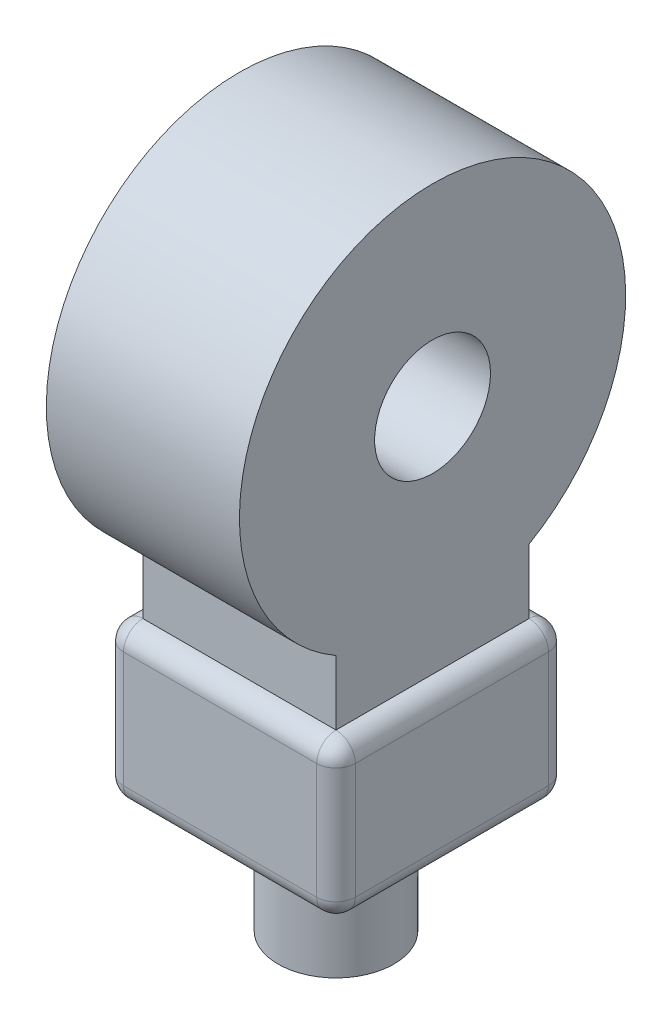
ISO-10303-21;
HEADER;
FILE_DESCRIPTION(('STEP AP214'),'2;1');
FILE_NAME('part.step','',(''),(''),'','','');
FILE_SCHEMA(('AUTOMOTIVE_DESIGN { 1 0 10303 214 1 1 1 1 }'));
ENDSEC;
DATA;
#1=APPLICATION_CONTEXT('core data for automotive mechanical design processes');
#2=APPLICATION_PROTOCOL_DEFINITION('international standard','automotive_design',2000,#1);
#3=PRODUCT_CONTEXT('',#1,'mechanical');
#4=PRODUCT('Part','Part','',(#3));
#5=PRODUCT_RELATED_PRODUCT_CATEGORY('part','',(#4));
#6=PRODUCT_DEFINITION_FORMATION('','',#4);
#7=PRODUCT_DEFINITION_CONTEXT('part definition',#1,'design');
#8=PRODUCT_DEFINITION('design','',#6,#7);
#9=PRODUCT_DEFINITION_SHAPE('','',#8);
#10=(LENGTH_UNIT() NAMED_UNIT(*) SI_UNIT(.MILLI.,.METRE.));
#11=(NAMED_UNIT(*) PLANE_ANGLE_UNIT() SI_UNIT($,.RADIAN.));
#12=(NAMED_UNIT(*) SI_UNIT($,.STERADIAN.) SOLID_ANGLE_UNIT());
#13=UNCERTAINTY_MEASURE_WITH_UNIT(LENGTH_MEASURE(1.E-05),#10,'distance_accuracy_value','');
#14=(GEOMETRIC_REPRESENTATION_CONTEXT(3) GLOBAL_UNCERTAINTY_ASSIGNED_CONTEXT((#13)) GLOBAL_UNIT_ASSIGNED_CONTEXT((#10,
#11,#12)) REPRESENTATION_CONTEXT('',''));
#15=CARTESIAN_POINT('',(0.,0.,0.));
#16=DIRECTION('',(0.,0.,1.));
#17=DIRECTION('',(1.,0.,0.));
#18=AXIS2_PLACEMENT_3D('',#15,#16,#17);
#19=CARTESIAN_POINT('',(30.,40.,30.));
#20=DIRECTION('',(-1.,0.,0.));
#21=DIRECTION('',(0.,0.,1.));
#22=AXIS2_PLACEMENT_3D('',#19,#20,#21);
#23=PLANE('',#22);
#24=DIRECTION('',(0.,-1.,0.));
#25=VECTOR('',#24,1.);
#26=CARTESIAN_POINT('',(30.,40.,-25.));
#27=LINE('',#26,#25);
#28=CARTESIAN_POINT('',(30.,5.,-25.));
#29=VERTEX_POINT('',#28);
#30=CARTESIAN_POINT('',(30.,35.,-25.));
#31=VERTEX_POINT('',#30);
#32=EDGE_CURVE('E214',#29,#31,#27,.F.);
#33=ORIENTED_EDGE('',*,*,#32,.T.);
#34=DIRECTION('',(0.,0.,-1.));
#35=VECTOR('',#34,1.);
#36=CARTESIAN_POINT('',(30.,35.,30.));
#37=LINE('',#36,#35);
#38=CARTESIAN_POINT('',(30.,35.,25.));
#39=VERTEX_POINT('',#38);
#40=EDGE_CURVE('E216',#31,#39,#37,.F.);
#41=ORIENTED_EDGE('',*,*,#40,.T.);
#42=DIRECTION('',(0.,-1.,0.));
#43=VECTOR('',#42,1.);
#44=CARTESIAN_POINT('',(30.,40.,25.));
#45=LINE('',#44,#43);
#46=CARTESIAN_POINT('',(30.,5.,25.));
#47=VERTEX_POINT('',#46);
#48=EDGE_CURVE('E210',#39,#47,#45,.T.);
#49=ORIENTED_EDGE('',*,*,#48,.T.);
#50=DIRECTION('',(0.,0.,-1.));
#51=VECTOR('',#50,1.);
#52=CARTESIAN_POINT('',(30.,5.,-30.));
#53=LINE('',#52,#51);
#54=EDGE_CURVE('E212',#47,#29,#53,.T.);
#55=ORIENTED_EDGE('',*,*,#54,.T.);
#56=EDGE_LOOP('',(#33,#41,#49,#55));
#57=FACE_BOUND('',#56,.T.);
#58=ADVANCED_FACE('F33',(#57),#23,.F.);
#59=CARTESIAN_POINT('',(-30.,40.,-30.));
#60=DIRECTION('',(0.,0.,1.));
#61=DIRECTION('',(1.,0.,0.));
#62=AXIS2_PLACEMENT_3D('',#59,#60,#61);
#63=PLANE('',#62);
#64=DIRECTION('',(0.,-1.,0.));
#65=VECTOR('',#64,1.);
#66=CARTESIAN_POINT('',(-25.,40.,-30.));
#67=LINE('',#66,#65);
#68=CARTESIAN_POINT('',(-25.,5.,-30.));
#69=VERTEX_POINT('',#68);
#70=CARTESIAN_POINT('',(-25.,35.,-30.));
#71=VERTEX_POINT('',#70);
#72=EDGE_CURVE('E205',#69,#71,#67,.F.);
#73=ORIENTED_EDGE('',*,*,#72,.T.);
#74=DIRECTION('',(-1.,0.,0.));
#75=VECTOR('',#74,1.);
#76=CARTESIAN_POINT('',(-30.,35.,-30.));
#77=LINE('',#76,#75);
#78=CARTESIAN_POINT('',(25.,35.,-30.));
#79=VERTEX_POINT('',#78);
#80=EDGE_CURVE('E207',#71,#79,#77,.F.);
#81=ORIENTED_EDGE('',*,*,#80,.T.);
#82=DIRECTION('',(0.,-1.,0.));
#83=VECTOR('',#82,1.);
#84=CARTESIAN_POINT('',(25.,40.,-30.));
#85=LINE('',#84,#83);
#86=CARTESIAN_POINT('',(25.,5.,-30.));
#87=VERTEX_POINT('',#86);
#88=EDGE_CURVE('E201',#79,#87,#85,.T.);
#89=ORIENTED_EDGE('',*,*,#88,.T.);
#90=DIRECTION('',(-1.,0.,0.));
#91=VECTOR('',#90,1.);
#92=CARTESIAN_POINT('',(-30.,5.,-30.));
#93=LINE('',#92,#91);
#94=EDGE_CURVE('E203',#87,#69,#93,.T.);
#95=ORIENTED_EDGE('',*,*,#94,.T.);
#96=EDGE_LOOP('',(#73,#81,#89,#95));
#97=FACE_BOUND('',#96,.T.);
#98=ADVANCED_FACE('F357',(#97),#63,.F.);
#99=CARTESIAN_POINT('',(-30.,40.,30.));
#100=DIRECTION('',(1.,0.,0.));
#101=DIRECTION('',(0.,0.,-1.));
#102=AXIS2_PLACEMENT_3D('',#99,#100,#101);
#103=PLANE('',#102);
#104=DIRECTION('',(0.,0.,1.));
#105=VECTOR('',#104,1.);
#106=CARTESIAN_POINT('',(-30.,35.,30.));
#107=LINE('',#106,#105);
#108=CARTESIAN_POINT('',(-30.,35.,25.));
#109=VERTEX_POINT('',#108);
#110=CARTESIAN_POINT('',(-30.,35.,-25.));
#111=VERTEX_POINT('',#110);
#112=EDGE_CURVE('E187',#109,#111,#107,.F.);
#113=ORIENTED_EDGE('',*,*,#112,.T.);
#114=DIRECTION('',(0.,-1.,0.));
#115=VECTOR('',#114,1.);
#116=CARTESIAN_POINT('',(-30.,40.,-25.));
#117=LINE('',#116,#115);
#118=CARTESIAN_POINT('',(-30.,5.,-25.));
#119=VERTEX_POINT('',#118);
#120=EDGE_CURVE('E190',#111,#119,#117,.T.);
#121=ORIENTED_EDGE('',*,*,#120,.T.);
#122=DIRECTION('',(0.,0.,1.));
#123=VECTOR('',#122,1.);
#124=CARTESIAN_POINT('',(-30.,5.,30.));
#125=LINE('',#124,#123);
#126=CARTESIAN_POINT('',(-30.,5.,25.));
#127=VERTEX_POINT('',#126);
#128=EDGE_CURVE('E185',#119,#127,#125,.T.);
#129=ORIENTED_EDGE('',*,*,#128,.T.);
#130=DIRECTION('',(0.,-1.,0.));
#131=VECTOR('',#130,1.);
#132=CARTESIAN_POINT('',(-30.,40.,25.));
#133=LINE('',#132,#131);
#134=EDGE_CURVE('E181',#127,#109,#133,.F.);
#135=ORIENTED_EDGE('',*,*,#134,.T.);
#136=EDGE_LOOP('',(#113,#121,#129,#135));
#137=FACE_BOUND('',#136,.T.);
#138=ADVANCED_FACE('F330',(#137),#103,.F.);
#139=CARTESIAN_POINT('',(-30.,40.,30.));
#140=DIRECTION('',(0.,0.,-1.));
#141=DIRECTION('',(-1.,0.,0.));
#142=AXIS2_PLACEMENT_3D('',#139,#140,#141);
#143=PLANE('',#142);
#144=DIRECTION('',(1.,0.,0.));
#145=VECTOR('',#144,1.);
#146=CARTESIAN_POINT('',(-30.,35.,30.));
#147=LINE('',#146,#145);
#148=CARTESIAN_POINT('',(25.,35.,30.));
#149=VERTEX_POINT('',#148);
#150=CARTESIAN_POINT('',(-25.,35.,30.));
#151=VERTEX_POINT('',#150);
#152=EDGE_CURVE('E42',#149,#151,#147,.F.);
#153=ORIENTED_EDGE('',*,*,#152,.T.);
#154=DIRECTION('',(0.,-1.,0.));
#155=VECTOR('',#154,1.);
#156=CARTESIAN_POINT('',(-25.,40.,30.));
#157=LINE('',#156,#155);
#158=CARTESIAN_POINT('',(-25.,5.,30.));
#159=VERTEX_POINT('',#158);
#160=EDGE_CURVE('E11',#151,#159,#157,.T.);
#161=ORIENTED_EDGE('',*,*,#160,.T.);
#162=DIRECTION('',(1.,0.,0.));
#163=VECTOR('',#162,1.);
#164=CARTESIAN_POINT('',(30.,5.,30.));
#165=LINE('',#164,#163);
#166=CARTESIAN_POINT('',(25.,5.,30.));
#167=VERTEX_POINT('',#166);
#168=EDGE_CURVE('E219',#159,#167,#165,.T.);
#169=ORIENTED_EDGE('',*,*,#168,.T.);
#170=DIRECTION('',(0.,-1.,0.));
#171=VECTOR('',#170,1.);
#172=CARTESIAN_POINT('',(25.,40.,30.));
#173=LINE('',#172,#171);
#174=EDGE_CURVE('E53',#167,#149,#173,.F.);
#175=ORIENTED_EDGE('',*,*,#174,.T.);
#176=EDGE_LOOP('',(#153,#161,#169,#175));
#177=FACE_BOUND('',#176,.T.);
#178=ADVANCED_FACE('F346',(#177),#143,.F.);
#179=CARTESIAN_POINT('',(0.,0.,0.));
#180=DIRECTION('',(0.,-1.,0.));
#181=DIRECTION('',(0.,0.,-1.));
#182=AXIS2_PLACEMENT_3D('',#179,#180,#181);
#183=PLANE('',#182);
#184=DIRECTION('',(1.,0.,0.));
#185=VECTOR('',#184,1.);
#186=CARTESIAN_POINT('',(-30.,0.,25.));
#187=LINE('',#186,#185);
#188=CARTESIAN_POINT('',(25.,0.,25.));
#189=VERTEX_POINT('',#188);
#190=CARTESIAN_POINT('',(-25.,0.,25.));
#191=VERTEX_POINT('',#190);
#192=EDGE_CURVE('E192',#189,#191,#187,.F.);
#193=ORIENTED_EDGE('',*,*,#192,.T.);
#194=DIRECTION('',(0.,0.,1.));
#195=VECTOR('',#194,1.);
#196=CARTESIAN_POINT('',(-25.,0.,-30.));
#197=LINE('',#196,#195);
#198=CARTESIAN_POINT('',(-25.,0.,-25.));
#199=VERTEX_POINT('',#198);
#200=EDGE_CURVE('E198',#191,#199,#197,.F.);
#201=ORIENTED_EDGE('',*,*,#200,.T.);
#202=DIRECTION('',(-1.,0.,0.));
#203=VECTOR('',#202,1.);
#204=CARTESIAN_POINT('',(30.,0.,-25.));
#205=LINE('',#204,#203);
#206=CARTESIAN_POINT('',(25.,0.,-25.));
#207=VERTEX_POINT('',#206);
#208=EDGE_CURVE('E196',#199,#207,#205,.F.);
#209=ORIENTED_EDGE('',*,*,#208,.T.);
#210=DIRECTION('',(0.,0.,-1.));
#211=VECTOR('',#210,1.);
#212=CARTESIAN_POINT('',(25.,0.,30.));
#213=LINE('',#212,#211);
#214=EDGE_CURVE('E194',#207,#189,#213,.F.);
#215=ORIENTED_EDGE('',*,*,#214,.T.);
#216=EDGE_LOOP('',(#193,#201,#209,#215));
#217=FACE_BOUND('',#216,.T.);
#218=CARTESIAN_POINT('',(0.,0.,0.));
#219=DIRECTION('',(0.,-1.,0.));
#220=DIRECTION('',(0.,0.,-1.));
#221=AXIS2_PLACEMENT_3D('',#218,#219,#220);
#222=CIRCLE('',#221,15.);
#223=CARTESIAN_POINT('',(0.,0.,-15.));
#224=VERTEX_POINT('',#223);
#225=EDGE_CURVE('E177',#224,#224,#222,.T.);
#226=ORIENTED_EDGE('',*,*,#225,.F.);
#227=EDGE_LOOP('',(#226));
#228=FACE_BOUND('',#227,.T.);
#229=ADVANCED_FACE('F348',(#217,#228),#183,.T.);
#230=CARTESIAN_POINT('',(0.,-30.,0.));
#231=DIRECTION('',(0.,1.,0.));
#232=DIRECTION('',(0.,0.,1.));
#233=AXIS2_PLACEMENT_3D('',#230,#231,#232);
#234=CYLINDRICAL_SURFACE('',#233,15.);
#235=CARTESIAN_POINT('',(0.,-30.,0.));
#236=DIRECTION('',(0.,-1.,0.));
#237=DIRECTION('',(0.,0.,-1.));
#238=AXIS2_PLACEMENT_3D('',#235,#236,#237);
#239=CIRCLE('',#238,15.);
#240=CARTESIAN_POINT('',(0.,-30.,-15.));
#241=VERTEX_POINT('',#240);
#242=EDGE_CURVE('E178',#241,#241,#239,.T.);
#243=ORIENTED_EDGE('',*,*,#242,.F.);
#244=EDGE_LOOP('',(#243));
#245=FACE_BOUND('',#244,.T.);
#246=ORIENTED_EDGE('',*,*,#225,.T.);
#247=EDGE_LOOP('',(#246));
#248=FACE_BOUND('',#247,.T.);
#249=ADVANCED_FACE('F354',(#245,#248),#234,.T.);
#250=CARTESIAN_POINT('',(0.,-30.,0.));
#251=DIRECTION('',(0.,-1.,0.));
#252=DIRECTION('',(0.,0.,-1.));
#253=AXIS2_PLACEMENT_3D('',#250,#251,#252);
#254=PLANE('',#253);
#255=ORIENTED_EDGE('',*,*,#242,.T.);
#256=EDGE_LOOP('',(#255));
#257=FACE_BOUND('',#256,.T.);
#258=ADVANCED_FACE('F451',(#257),#254,.T.);
#259=CARTESIAN_POINT('',(25.,100.,0.));
#260=DIRECTION('',(1.,0.,0.));
#261=DIRECTION('',(0.,0.,-1.));
#262=AXIS2_PLACEMENT_3D('',#259,#260,#261);
#263=PLANE('',#262);
#264=DIRECTION('',(0.,-1.,0.));
#265=VECTOR('',#264,1.);
#266=CARTESIAN_POINT('',(25.,40.,25.));
#267=LINE('',#266,#265);
#268=CARTESIAN_POINT('',(25.,56.6987298107781,25.));
#269=VERTEX_POINT('',#268);
#270=CARTESIAN_POINT('',(25.,40.,25.));
#271=VERTEX_POINT('',#270);
#272=EDGE_CURVE('E171',#269,#271,#267,.T.);
#273=ORIENTED_EDGE('',*,*,#272,.T.);
#274=DIRECTION('',(0.,0.,-1.));
#275=VECTOR('',#274,1.);
#276=CARTESIAN_POINT('',(25.,40.,25.));
#277=LINE('',#276,#275);
#278=CARTESIAN_POINT('',(25.,40.,-25.));
#279=VERTEX_POINT('',#278);
#280=EDGE_CURVE('E141',#271,#279,#277,.T.);
#281=ORIENTED_EDGE('',*,*,#280,.T.);
#282=DIRECTION('',(0.,1.,0.));
#283=VECTOR('',#282,1.);
#284=CARTESIAN_POINT('',(25.,40.,-25.));
#285=LINE('',#284,#283);
#286=CARTESIAN_POINT('',(25.,56.6987298107781,-25.));
#287=VERTEX_POINT('',#286);
#288=EDGE_CURVE('E133',#279,#287,#285,.T.);
#289=ORIENTED_EDGE('',*,*,#288,.T.);
#290=CARTESIAN_POINT('',(25.,100.,0.));
#291=DIRECTION('',(1.,0.,0.));
#292=DIRECTION('',(0.,0.,-1.));
#293=AXIS2_PLACEMENT_3D('',#290,#291,#292);
#294=CIRCLE('',#293,50.);
#295=EDGE_CURVE('E138',#287,#269,#294,.T.);
#296=ORIENTED_EDGE('',*,*,#295,.T.);
#297=EDGE_LOOP('',(#273,#281,#289,#296));
#298=FACE_BOUND('',#297,.T.);
#299=CARTESIAN_POINT('',(25.,100.,0.));
#300=DIRECTION('',(1.,0.,0.));
#301=DIRECTION('',(0.,0.,-1.));
#302=AXIS2_PLACEMENT_3D('',#299,#300,#301);
#303=CIRCLE('',#302,15.);
#304=CARTESIAN_POINT('',(25.,100.,-15.));
#305=VERTEX_POINT('',#304);
#306=EDGE_CURVE('E166',#305,#305,#303,.T.);
#307=ORIENTED_EDGE('',*,*,#306,.F.);
#308=EDGE_LOOP('',(#307));
#309=FACE_BOUND('',#308,.T.);
#310=ADVANCED_FACE('F135',(#298,#309),#263,.T.);
#311=CARTESIAN_POINT('',(-25.,100.,0.));
#312=DIRECTION('',(1.,0.,0.));
#313=DIRECTION('',(0.,0.,-1.));
#314=AXIS2_PLACEMENT_3D('',#311,#312,#313);
#315=PLANE('',#314);
#316=DIRECTION('',(0.,-1.,0.));
#317=VECTOR('',#316,1.);
#318=CARTESIAN_POINT('',(-25.,40.,25.));
#319=LINE('',#318,#317);
#320=CARTESIAN_POINT('',(-25.,56.6987298107781,25.));
#321=VERTEX_POINT('',#320);
#322=CARTESIAN_POINT('',(-25.,40.,25.));
#323=VERTEX_POINT('',#322);
#324=EDGE_CURVE('E162',#321,#323,#319,.T.);
#325=ORIENTED_EDGE('',*,*,#324,.F.);
#326=CARTESIAN_POINT('',(-25.,100.,0.));
#327=DIRECTION('',(1.,0.,0.));
#328=DIRECTION('',(0.,0.,-1.));
#329=AXIS2_PLACEMENT_3D('',#326,#327,#328);
#330=CIRCLE('',#329,50.);
#331=CARTESIAN_POINT('',(-25.,56.6987298107781,-25.));
#332=VERTEX_POINT('',#331);
#333=EDGE_CURVE('E170',#332,#321,#330,.T.);
#334=ORIENTED_EDGE('',*,*,#333,.F.);
#335=DIRECTION('',(0.,1.,0.));
#336=VECTOR('',#335,1.);
#337=CARTESIAN_POINT('',(-25.,40.,-25.));
#338=LINE('',#337,#336);
#339=CARTESIAN_POINT('',(-25.,40.,-25.));
#340=VERTEX_POINT('',#339);
#341=EDGE_CURVE('E149',#340,#332,#338,.T.);
#342=ORIENTED_EDGE('',*,*,#341,.F.);
#343=DIRECTION('',(0.,0.,-1.));
#344=VECTOR('',#343,1.);
#345=CARTESIAN_POINT('',(-25.,40.,25.));
#346=LINE('',#345,#344);
#347=EDGE_CURVE('E165',#323,#340,#346,.T.);
#348=ORIENTED_EDGE('',*,*,#347,.F.);
#349=EDGE_LOOP('',(#325,#334,#342,#348));
#350=FACE_BOUND('',#349,.T.);
#351=CARTESIAN_POINT('',(-25.,100.,0.));
#352=DIRECTION('',(1.,0.,0.));
#353=DIRECTION('',(0.,0.,-1.));
#354=AXIS2_PLACEMENT_3D('',#351,#352,#353);
#355=CIRCLE('',#354,15.);
#356=CARTESIAN_POINT('',(-25.,100.,-15.));
#357=VERTEX_POINT('',#356);
#358=EDGE_CURVE('E289',#357,#357,#355,.T.);
#359=ORIENTED_EDGE('',*,*,#358,.T.);
#360=EDGE_LOOP('',(#359));
#361=FACE_BOUND('',#360,.T.);
#362=ADVANCED_FACE('F443',(#350,#361),#315,.F.);
#363=CARTESIAN_POINT('',(25.,40.,25.));
#364=DIRECTION('',(0.,0.,-1.));
#365=DIRECTION('',(-1.,0.,0.));
#366=AXIS2_PLACEMENT_3D('',#363,#364,#365);
#367=PLANE('',#366);
#368=ORIENTED_EDGE('',*,*,#324,.T.);
#369=DIRECTION('',(-1.,0.,0.));
#370=VECTOR('',#369,1.);
#371=CARTESIAN_POINT('',(25.,40.,25.));
#372=LINE('',#371,#370);
#373=EDGE_CURVE('E174',#271,#323,#372,.T.);
#374=ORIENTED_EDGE('',*,*,#373,.F.);
#375=ORIENTED_EDGE('',*,*,#272,.F.);
#376=DIRECTION('',(-1.,0.,0.));
#377=VECTOR('',#376,1.);
#378=CARTESIAN_POINT('',(25.,56.6987298107781,25.));
#379=LINE('',#378,#377);
#380=EDGE_CURVE('E153',#269,#321,#379,.T.);
#381=ORIENTED_EDGE('',*,*,#380,.T.);
#382=EDGE_LOOP('',(#368,#374,#375,#381));
#383=FACE_BOUND('',#382,.T.);
#384=ADVANCED_FACE('F303',(#383),#367,.F.);
#385=CARTESIAN_POINT('',(25.,40.,-25.));
#386=DIRECTION('',(0.,0.,1.));
#387=DIRECTION('',(1.,0.,0.));
#388=AXIS2_PLACEMENT_3D('',#385,#386,#387);
#389=PLANE('',#388);
#390=ORIENTED_EDGE('',*,*,#341,.T.);
#391=DIRECTION('',(-1.,0.,0.));
#392=VECTOR('',#391,1.);
#393=CARTESIAN_POINT('',(25.,56.6987298107781,-25.));
#394=LINE('',#393,#392);
#395=EDGE_CURVE('E146',#287,#332,#394,.T.);
#396=ORIENTED_EDGE('',*,*,#395,.F.);
#397=ORIENTED_EDGE('',*,*,#288,.F.);
#398=DIRECTION('',(-1.,0.,0.));
#399=VECTOR('',#398,1.);
#400=CARTESIAN_POINT('',(25.,40.,-25.));
#401=LINE('',#400,#399);
#402=EDGE_CURVE('E152',#279,#340,#401,.T.);
#403=ORIENTED_EDGE('',*,*,#402,.T.);
#404=EDGE_LOOP('',(#390,#396,#397,#403));
#405=FACE_BOUND('',#404,.T.);
#406=ADVANCED_FACE('F147',(#405),#389,.F.);
#407=CARTESIAN_POINT('',(25.,100.,0.));
#408=DIRECTION('',(-1.,0.,0.));
#409=DIRECTION('',(0.,0.,1.));
#410=AXIS2_PLACEMENT_3D('',#407,#408,#409);
#411=CYLINDRICAL_SURFACE('',#410,50.);
#412=ORIENTED_EDGE('',*,*,#333,.T.);
#413=ORIENTED_EDGE('',*,*,#380,.F.);
#414=ORIENTED_EDGE('',*,*,#295,.F.);
#415=ORIENTED_EDGE('',*,*,#395,.T.);
#416=EDGE_LOOP('',(#412,#413,#414,#415));
#417=FACE_BOUND('',#416,.T.);
#418=ADVANCED_FACE('F155',(#417),#411,.T.);
#419=CARTESIAN_POINT('',(25.,100.,0.));
#420=DIRECTION('',(-1.,0.,0.));
#421=DIRECTION('',(0.,0.,1.));
#422=AXIS2_PLACEMENT_3D('',#419,#420,#421);
#423=CYLINDRICAL_SURFACE('',#422,15.);
#424=ORIENTED_EDGE('',*,*,#306,.T.);
#425=EDGE_LOOP('',(#424));
#426=FACE_BOUND('',#425,.T.);
#427=ORIENTED_EDGE('',*,*,#358,.F.);
#428=EDGE_LOOP('',(#427));
#429=FACE_BOUND('',#428,.T.);
#430=ADVANCED_FACE('F425',(#426,#429),#423,.F.);
#431=CARTESIAN_POINT('',(25.,5.,30.));
#432=DIRECTION('',(0.,0.,1.));
#433=DIRECTION('',(1.,0.,0.));
#434=AXIS2_PLACEMENT_3D('',#431,#432,#433);
#435=CYLINDRICAL_SURFACE('',#434,5.);
#436=CARTESIAN_POINT('',(25.,5.,-25.));
#437=DIRECTION('',(0.,0.,-1.));
#438=DIRECTION('',(-1.,0.,0.));
#439=AXIS2_PLACEMENT_3D('',#436,#437,#438);
#440=CIRCLE('',#439,5.);
#441=EDGE_CURVE('E37',#29,#207,#440,.T.);
#442=ORIENTED_EDGE('',*,*,#441,.F.);
#443=ORIENTED_EDGE('',*,*,#54,.F.);
#444=CARTESIAN_POINT('',(25.,5.,25.));
#445=DIRECTION('',(0.,0.,1.));
#446=DIRECTION('',(1.,0.,0.));
#447=AXIS2_PLACEMENT_3D('',#444,#445,#446);
#448=CIRCLE('',#447,5.);
#449=EDGE_CURVE('E282',#189,#47,#448,.T.);
#450=ORIENTED_EDGE('',*,*,#449,.F.);
#451=ORIENTED_EDGE('',*,*,#214,.F.);
#452=EDGE_LOOP('',(#442,#443,#450,#451));
#453=FACE_BOUND('',#452,.T.);
#454=ADVANCED_FACE('F35',(#453),#435,.T.);
#455=CARTESIAN_POINT('',(25.,5.,-25.));
#456=DIRECTION('',(0.,0.,1.));
#457=DIRECTION('',(1.,0.,0.));
#458=AXIS2_PLACEMENT_3D('',#455,#456,#457);
#459=SPHERICAL_SURFACE('',#458,5.);
#460=CARTESIAN_POINT('',(25.,5.,-25.));
#461=DIRECTION('',(0.,-1.,0.));
#462=DIRECTION('',(0.,0.,-1.));
#463=AXIS2_PLACEMENT_3D('',#460,#461,#462);
#464=CIRCLE('',#463,5.);
#465=EDGE_CURVE('E277',#29,#87,#464,.F.);
#466=ORIENTED_EDGE('',*,*,#465,.F.);
#467=ORIENTED_EDGE('',*,*,#441,.T.);
#468=CARTESIAN_POINT('',(25.,5.,-25.));
#469=DIRECTION('',(1.,0.,0.));
#470=DIRECTION('',(0.,0.,-1.));
#471=AXIS2_PLACEMENT_3D('',#468,#469,#470);
#472=CIRCLE('',#471,5.);
#473=EDGE_CURVE('E280',#87,#207,#472,.F.);
#474=ORIENTED_EDGE('',*,*,#473,.F.);
#475=EDGE_LOOP('',(#466,#467,#474));
#476=FACE_BOUND('',#475,.T.);
#477=ADVANCED_FACE('F420',(#476),#459,.T.);
#478=CARTESIAN_POINT('',(25.,5.,25.));
#479=DIRECTION('',(0.,0.,1.));
#480=DIRECTION('',(1.,0.,0.));
#481=AXIS2_PLACEMENT_3D('',#478,#479,#480);
#482=SPHERICAL_SURFACE('',#481,5.);
#483=CARTESIAN_POINT('',(25.,5.,25.));
#484=DIRECTION('',(1.,0.,0.));
#485=DIRECTION('',(0.,0.,-1.));
#486=AXIS2_PLACEMENT_3D('',#483,#484,#485);
#487=CIRCLE('',#486,5.);
#488=EDGE_CURVE('E271',#189,#167,#487,.F.);
#489=ORIENTED_EDGE('',*,*,#488,.F.);
#490=ORIENTED_EDGE('',*,*,#449,.T.);
#491=CARTESIAN_POINT('',(25.,5.,25.));
#492=DIRECTION('',(0.,-1.,0.));
#493=DIRECTION('',(0.,0.,-1.));
#494=AXIS2_PLACEMENT_3D('',#491,#492,#493);
#495=CIRCLE('',#494,5.);
#496=EDGE_CURVE('E274',#167,#47,#495,.F.);
#497=ORIENTED_EDGE('',*,*,#496,.F.);
#498=EDGE_LOOP('',(#489,#490,#497));
#499=FACE_BOUND('',#498,.T.);
#500=ADVANCED_FACE('F417',(#499),#482,.T.);
#501=CARTESIAN_POINT('',(-30.,5.,-25.));
#502=DIRECTION('',(1.,0.,0.));
#503=DIRECTION('',(0.,0.,-1.));
#504=AXIS2_PLACEMENT_3D('',#501,#502,#503);
#505=CYLINDRICAL_SURFACE('',#504,5.);
#506=ORIENTED_EDGE('',*,*,#473,.T.);
#507=ORIENTED_EDGE('',*,*,#208,.F.);
#508=CARTESIAN_POINT('',(-25.,5.,-25.));
#509=DIRECTION('',(-1.,0.,0.));
#510=DIRECTION('',(0.,0.,1.));
#511=AXIS2_PLACEMENT_3D('',#508,#509,#510);
#512=CIRCLE('',#511,5.);
#513=EDGE_CURVE('E266',#69,#199,#512,.T.);
#514=ORIENTED_EDGE('',*,*,#513,.F.);
#515=ORIENTED_EDGE('',*,*,#94,.F.);
#516=EDGE_LOOP('',(#506,#507,#514,#515));
#517=FACE_BOUND('',#516,.T.);
#518=ADVANCED_FACE('F413',(#517),#505,.T.);
#519=CARTESIAN_POINT('',(25.,40.,-25.));
#520=DIRECTION('',(0.,-1.,0.));
#521=DIRECTION('',(0.,0.,-1.));
#522=AXIS2_PLACEMENT_3D('',#519,#520,#521);
#523=CYLINDRICAL_SURFACE('',#522,5.);
#524=ORIENTED_EDGE('',*,*,#465,.T.);
#525=ORIENTED_EDGE('',*,*,#88,.F.);
#526=CARTESIAN_POINT('',(25.,35.,-25.));
#527=DIRECTION('',(0.,1.,0.));
#528=DIRECTION('',(0.,0.,1.));
#529=AXIS2_PLACEMENT_3D('',#526,#527,#528);
#530=CIRCLE('',#529,5.);
#531=EDGE_CURVE('E263',#31,#79,#530,.T.);
#532=ORIENTED_EDGE('',*,*,#531,.F.);
#533=ORIENTED_EDGE('',*,*,#32,.F.);
#534=EDGE_LOOP('',(#524,#525,#532,#533));
#535=FACE_BOUND('',#534,.T.);
#536=ADVANCED_FACE('F410',(#535),#523,.T.);
#537=CARTESIAN_POINT('',(25.,35.,0.));
#538=DIRECTION('',(0.,0.,-1.));
#539=DIRECTION('',(-1.,0.,0.));
#540=AXIS2_PLACEMENT_3D('',#537,#538,#539);
#541=CYLINDRICAL_SURFACE('',#540,5.);
#542=CARTESIAN_POINT('',(25.,35.,25.));
#543=DIRECTION('',(0.,0.,1.));
#544=DIRECTION('',(1.,0.,0.));
#545=AXIS2_PLACEMENT_3D('',#542,#543,#544);
#546=CIRCLE('',#545,5.);
#547=EDGE_CURVE('E257',#39,#271,#546,.T.);
#548=ORIENTED_EDGE('',*,*,#547,.F.);
#549=ORIENTED_EDGE('',*,*,#40,.F.);
#550=CARTESIAN_POINT('',(25.,35.,-25.));
#551=DIRECTION('',(0.,0.,-1.));
#552=DIRECTION('',(-1.,0.,0.));
#553=AXIS2_PLACEMENT_3D('',#550,#551,#552);
#554=CIRCLE('',#553,5.);
#555=EDGE_CURVE('E260',#279,#31,#554,.T.);
#556=ORIENTED_EDGE('',*,*,#555,.F.);
#557=ORIENTED_EDGE('',*,*,#280,.F.);
#558=EDGE_LOOP('',(#548,#549,#556,#557));
#559=FACE_BOUND('',#558,.T.);
#560=ADVANCED_FACE('F310',(#559),#541,.T.);
#561=CARTESIAN_POINT('',(25.,40.,25.));
#562=DIRECTION('',(0.,-1.,0.));
#563=DIRECTION('',(0.,0.,-1.));
#564=AXIS2_PLACEMENT_3D('',#561,#562,#563);
#565=CYLINDRICAL_SURFACE('',#564,5.);
#566=ORIENTED_EDGE('',*,*,#496,.T.);
#567=ORIENTED_EDGE('',*,*,#48,.F.);
#568=CARTESIAN_POINT('',(25.,35.,25.));
#569=DIRECTION('',(0.,1.,0.));
#570=DIRECTION('',(0.,0.,1.));
#571=AXIS2_PLACEMENT_3D('',#568,#569,#570);
#572=CIRCLE('',#571,5.);
#573=EDGE_CURVE('E255',#149,#39,#572,.T.);
#574=ORIENTED_EDGE('',*,*,#573,.F.);
#575=ORIENTED_EDGE('',*,*,#174,.F.);
#576=EDGE_LOOP('',(#566,#567,#574,#575));
#577=FACE_BOUND('',#576,.T.);
#578=ADVANCED_FACE('F404',(#577),#565,.T.);
#579=CARTESIAN_POINT('',(-30.,5.,25.));
#580=DIRECTION('',(-1.,0.,0.));
#581=DIRECTION('',(0.,0.,1.));
#582=AXIS2_PLACEMENT_3D('',#579,#580,#581);
#583=CYLINDRICAL_SURFACE('',#582,5.);
#584=ORIENTED_EDGE('',*,*,#488,.T.);
#585=ORIENTED_EDGE('',*,*,#168,.F.);
#586=CARTESIAN_POINT('',(-25.,5.,25.));
#587=DIRECTION('',(-1.,0.,0.));
#588=DIRECTION('',(0.,0.,1.));
#589=AXIS2_PLACEMENT_3D('',#586,#587,#588);
#590=CIRCLE('',#589,5.);
#591=EDGE_CURVE('E252',#191,#159,#590,.T.);
#592=ORIENTED_EDGE('',*,*,#591,.F.);
#593=ORIENTED_EDGE('',*,*,#192,.F.);
#594=EDGE_LOOP('',(#584,#585,#592,#593));
#595=FACE_BOUND('',#594,.T.);
#596=ADVANCED_FACE('F345',(#595),#583,.T.);
#597=CARTESIAN_POINT('',(-25.,5.,30.));
#598=DIRECTION('',(0.,0.,-1.));
#599=DIRECTION('',(-1.,0.,0.));
#600=AXIS2_PLACEMENT_3D('',#597,#598,#599);
#601=CYLINDRICAL_SURFACE('',#600,5.);
#602=CARTESIAN_POINT('',(-25.,5.,-25.));
#603=DIRECTION('',(0.,0.,-1.));
#604=DIRECTION('',(-1.,0.,0.));
#605=AXIS2_PLACEMENT_3D('',#602,#603,#604);
#606=CIRCLE('',#605,5.);
#607=EDGE_CURVE('E268',#199,#119,#606,.T.);
#608=ORIENTED_EDGE('',*,*,#607,.F.);
#609=ORIENTED_EDGE('',*,*,#200,.F.);
#610=CARTESIAN_POINT('',(-25.,5.,25.));
#611=DIRECTION('',(0.,0.,1.));
#612=DIRECTION('',(1.,0.,0.));
#613=AXIS2_PLACEMENT_3D('',#610,#611,#612);
#614=CIRCLE('',#613,5.);
#615=EDGE_CURVE('E249',#127,#191,#614,.T.);
#616=ORIENTED_EDGE('',*,*,#615,.F.);
#617=ORIENTED_EDGE('',*,*,#128,.F.);
#618=EDGE_LOOP('',(#608,#609,#616,#617));
#619=FACE_BOUND('',#618,.T.);
#620=ADVANCED_FACE('F338',(#619),#601,.T.);
#621=CARTESIAN_POINT('',(-25.,5.,-25.));
#622=DIRECTION('',(0.,0.,1.));
#623=DIRECTION('',(1.,0.,0.));
#624=AXIS2_PLACEMENT_3D('',#621,#622,#623);
#625=SPHERICAL_SURFACE('',#624,5.);
#626=ORIENTED_EDGE('',*,*,#513,.T.);
#627=ORIENTED_EDGE('',*,*,#607,.T.);
#628=CARTESIAN_POINT('',(-25.,5.,-25.));
#629=DIRECTION('',(0.,-1.,0.));
#630=DIRECTION('',(0.,0.,-1.));
#631=AXIS2_PLACEMENT_3D('',#628,#629,#630);
#632=CIRCLE('',#631,5.);
#633=EDGE_CURVE('E246',#69,#119,#632,.F.);
#634=ORIENTED_EDGE('',*,*,#633,.F.);
#635=EDGE_LOOP('',(#626,#627,#634));
#636=FACE_BOUND('',#635,.T.);
#637=ADVANCED_FACE('F395',(#636),#625,.T.);
#638=CARTESIAN_POINT('',(25.,35.,-25.));
#639=DIRECTION('',(0.,0.,1.));
#640=DIRECTION('',(1.,0.,0.));
#641=AXIS2_PLACEMENT_3D('',#638,#639,#640);
#642=SPHERICAL_SURFACE('',#641,5.);
#643=ORIENTED_EDGE('',*,*,#555,.T.);
#644=ORIENTED_EDGE('',*,*,#531,.T.);
#645=CARTESIAN_POINT('',(25.,35.,-25.));
#646=DIRECTION('',(1.,0.,0.));
#647=DIRECTION('',(0.,1.,0.));
#648=AXIS2_PLACEMENT_3D('',#645,#646,#647);
#649=CIRCLE('',#648,5.);
#650=EDGE_CURVE('E244',#279,#79,#649,.F.);
#651=ORIENTED_EDGE('',*,*,#650,.F.);
#652=EDGE_LOOP('',(#643,#644,#651));
#653=FACE_BOUND('',#652,.T.);
#654=ADVANCED_FACE('F392',(#653),#642,.T.);
#655=CARTESIAN_POINT('',(25.,35.,25.));
#656=DIRECTION('',(0.,0.,1.));
#657=DIRECTION('',(1.,0.,0.));
#658=AXIS2_PLACEMENT_3D('',#655,#656,#657);
#659=SPHERICAL_SURFACE('',#658,5.);
#660=ORIENTED_EDGE('',*,*,#573,.T.);
#661=ORIENTED_EDGE('',*,*,#547,.T.);
#662=CARTESIAN_POINT('',(25.,35.,25.));
#663=DIRECTION('',(1.,0.,0.));
#664=DIRECTION('',(0.,0.,-1.));
#665=AXIS2_PLACEMENT_3D('',#662,#663,#664);
#666=CIRCLE('',#665,5.);
#667=EDGE_CURVE('E241',#149,#271,#666,.F.);
#668=ORIENTED_EDGE('',*,*,#667,.F.);
#669=EDGE_LOOP('',(#660,#661,#668));
#670=FACE_BOUND('',#669,.T.);
#671=ADVANCED_FACE('F316',(#670),#659,.T.);
#672=CARTESIAN_POINT('',(-25.,5.,25.));
#673=DIRECTION('',(0.,0.,1.));
#674=DIRECTION('',(1.,0.,0.));
#675=AXIS2_PLACEMENT_3D('',#672,#673,#674);
#676=SPHERICAL_SURFACE('',#675,5.);
#677=ORIENTED_EDGE('',*,*,#615,.T.);
#678=ORIENTED_EDGE('',*,*,#591,.T.);
#679=CARTESIAN_POINT('',(-25.,5.,25.));
#680=DIRECTION('',(0.,-1.,0.));
#681=DIRECTION('',(0.,0.,-1.));
#682=AXIS2_PLACEMENT_3D('',#679,#680,#681);
#683=CIRCLE('',#682,5.);
#684=EDGE_CURVE('E239',#127,#159,#683,.F.);
#685=ORIENTED_EDGE('',*,*,#684,.F.);
#686=EDGE_LOOP('',(#677,#678,#685));
#687=FACE_BOUND('',#686,.T.);
#688=ADVANCED_FACE('F341',(#687),#676,.T.);
#689=CARTESIAN_POINT('',(-25.,40.,-25.));
#690=DIRECTION('',(0.,-1.,0.));
#691=DIRECTION('',(0.,0.,-1.));
#692=AXIS2_PLACEMENT_3D('',#689,#690,#691);
#693=CYLINDRICAL_SURFACE('',#692,5.);
#694=ORIENTED_EDGE('',*,*,#633,.T.);
#695=ORIENTED_EDGE('',*,*,#120,.F.);
#696=CARTESIAN_POINT('',(-25.,35.,-25.));
#697=DIRECTION('',(0.,1.,0.));
#698=DIRECTION('',(0.,0.,1.));
#699=AXIS2_PLACEMENT_3D('',#696,#697,#698);
#700=CIRCLE('',#699,5.);
#701=EDGE_CURVE('E236',#71,#111,#700,.T.);
#702=ORIENTED_EDGE('',*,*,#701,.F.);
#703=ORIENTED_EDGE('',*,*,#72,.F.);
#704=EDGE_LOOP('',(#694,#695,#702,#703));
#705=FACE_BOUND('',#704,.T.);
#706=ADVANCED_FACE('F383',(#705),#693,.T.);
#707=CARTESIAN_POINT('',(0.,35.,-25.));
#708=DIRECTION('',(-1.,0.,0.));
#709=DIRECTION('',(0.,0.,1.));
#710=AXIS2_PLACEMENT_3D('',#707,#708,#709);
#711=CYLINDRICAL_SURFACE('',#710,5.);
#712=ORIENTED_EDGE('',*,*,#650,.T.);
#713=ORIENTED_EDGE('',*,*,#80,.F.);
#714=CARTESIAN_POINT('',(-25.,35.,-25.));
#715=DIRECTION('',(-1.,0.,0.));
#716=DIRECTION('',(0.,0.,1.));
#717=AXIS2_PLACEMENT_3D('',#714,#715,#716);
#718=CIRCLE('',#717,5.);
#719=EDGE_CURVE('E233',#340,#71,#718,.T.);
#720=ORIENTED_EDGE('',*,*,#719,.F.);
#721=ORIENTED_EDGE('',*,*,#402,.F.);
#722=EDGE_LOOP('',(#712,#713,#720,#721));
#723=FACE_BOUND('',#722,.T.);
#724=ADVANCED_FACE('F380',(#723),#711,.T.);
#725=CARTESIAN_POINT('',(0.,35.,25.));
#726=DIRECTION('',(1.,0.,0.));
#727=DIRECTION('',(0.,0.,-1.));
#728=AXIS2_PLACEMENT_3D('',#725,#726,#727);
#729=CYLINDRICAL_SURFACE('',#728,5.);
#730=ORIENTED_EDGE('',*,*,#667,.T.);
#731=ORIENTED_EDGE('',*,*,#373,.T.);
#732=CARTESIAN_POINT('',(-25.,35.,25.));
#733=DIRECTION('',(-1.,0.,0.));
#734=DIRECTION('',(0.,0.,1.));
#735=AXIS2_PLACEMENT_3D('',#732,#733,#734);
#736=CIRCLE('',#735,5.);
#737=EDGE_CURVE('E230',#151,#323,#736,.T.);
#738=ORIENTED_EDGE('',*,*,#737,.F.);
#739=ORIENTED_EDGE('',*,*,#152,.F.);
#740=EDGE_LOOP('',(#730,#731,#738,#739));
#741=FACE_BOUND('',#740,.T.);
#742=ADVANCED_FACE('F317',(#741),#729,.T.);
#743=CARTESIAN_POINT('',(-25.,40.,25.));
#744=DIRECTION('',(0.,-1.,0.));
#745=DIRECTION('',(0.,0.,-1.));
#746=AXIS2_PLACEMENT_3D('',#743,#744,#745);
#747=CYLINDRICAL_SURFACE('',#746,5.);
#748=ORIENTED_EDGE('',*,*,#684,.T.);
#749=ORIENTED_EDGE('',*,*,#160,.F.);
#750=CARTESIAN_POINT('',(-25.,35.,25.));
#751=DIRECTION('',(0.,1.,0.));
#752=DIRECTION('',(0.,0.,1.));
#753=AXIS2_PLACEMENT_3D('',#750,#751,#752);
#754=CIRCLE('',#753,5.);
#755=EDGE_CURVE('E227',#109,#151,#754,.T.);
#756=ORIENTED_EDGE('',*,*,#755,.F.);
#757=ORIENTED_EDGE('',*,*,#134,.F.);
#758=EDGE_LOOP('',(#748,#749,#756,#757));
#759=FACE_BOUND('',#758,.T.);
#760=ADVANCED_FACE('F325',(#759),#747,.T.);
#761=CARTESIAN_POINT('',(-25.,35.,-25.));
#762=DIRECTION('',(0.,0.,1.));
#763=DIRECTION('',(1.,0.,0.));
#764=AXIS2_PLACEMENT_3D('',#761,#762,#763);
#765=SPHERICAL_SURFACE('',#764,5.);
#766=ORIENTED_EDGE('',*,*,#719,.T.);
#767=ORIENTED_EDGE('',*,*,#701,.T.);
#768=CARTESIAN_POINT('',(-25.,35.,-25.));
#769=DIRECTION('',(0.,0.,-1.));
#770=DIRECTION('',(0.,1.,0.));
#771=AXIS2_PLACEMENT_3D('',#768,#769,#770);
#772=CIRCLE('',#771,5.);
#773=EDGE_CURVE('E225',#340,#111,#772,.F.);
#774=ORIENTED_EDGE('',*,*,#773,.F.);
#775=EDGE_LOOP('',(#766,#767,#774));
#776=FACE_BOUND('',#775,.T.);
#777=ADVANCED_FACE('F372',(#776),#765,.T.);
#778=CARTESIAN_POINT('',(-25.,35.,25.));
#779=DIRECTION('',(0.,0.,1.));
#780=DIRECTION('',(1.,0.,0.));
#781=AXIS2_PLACEMENT_3D('',#778,#779,#780);
#782=SPHERICAL_SURFACE('',#781,5.);
#783=ORIENTED_EDGE('',*,*,#755,.T.);
#784=ORIENTED_EDGE('',*,*,#737,.T.);
#785=CARTESIAN_POINT('',(-25.,35.,25.));
#786=DIRECTION('',(0.,0.,1.));
#787=DIRECTION('',(1.,0.,0.));
#788=AXIS2_PLACEMENT_3D('',#785,#786,#787);
#789=CIRCLE('',#788,5.);
#790=EDGE_CURVE('E223',#109,#323,#789,.F.);
#791=ORIENTED_EDGE('',*,*,#790,.F.);
#792=EDGE_LOOP('',(#783,#784,#791));
#793=FACE_BOUND('',#792,.T.);
#794=ADVANCED_FACE('F321',(#793),#782,.T.);
#795=CARTESIAN_POINT('',(-25.,35.,0.));
#796=DIRECTION('',(0.,0.,1.));
#797=DIRECTION('',(1.,0.,0.));
#798=AXIS2_PLACEMENT_3D('',#795,#796,#797);
#799=CYLINDRICAL_SURFACE('',#798,5.);
#800=ORIENTED_EDGE('',*,*,#773,.T.);
#801=ORIENTED_EDGE('',*,*,#112,.F.);
#802=ORIENTED_EDGE('',*,*,#790,.T.);
#803=ORIENTED_EDGE('',*,*,#347,.T.);
#804=EDGE_LOOP('',(#800,#801,#802,#803));
#805=FACE_BOUND('',#804,.T.);
#806=ADVANCED_FACE('F327',(#805),#799,.T.);
#807=CLOSED_SHELL('',(#58,#98,#138,#178,#229,#249,#258,#310,#362,#384,#406,#418,#430,#454,#477,
#500,#518,#536,#560,#578,#596,#620,#637,#654,#671,#688,#706,#724,#742,#760,#777,#794,#806));
#808=MANIFOLD_SOLID_BREP('B2',#807);
#809=ADVANCED_BREP_SHAPE_REPRESENTATION('',(#18,#808),#14);
#810=SHAPE_DEFINITION_REPRESENTATION(#9,#809);
ENDSEC;
END-ISO-10303-21;
